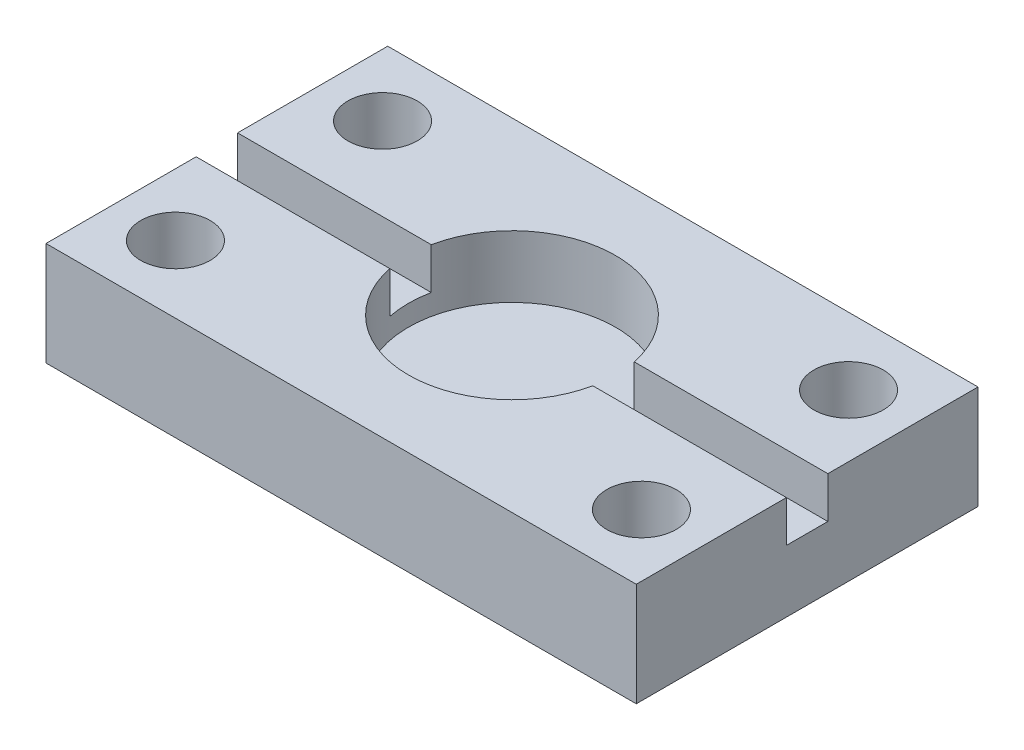
ISO-10303-21;
HEADER;
FILE_DESCRIPTION(('STEP AP214'),'2;1');
FILE_NAME('part.step','',(''),(''),'','','');
FILE_SCHEMA(('AUTOMOTIVE_DESIGN { 1 0 10303 214 1 1 1 1 }'));
ENDSEC;
DATA;
#1=APPLICATION_CONTEXT('core data for automotive mechanical design processes');
#2=APPLICATION_PROTOCOL_DEFINITION('international standard','automotive_design',2000,#1);
#3=PRODUCT_CONTEXT('',#1,'mechanical');
#4=PRODUCT('Part','Part','',(#3));
#5=PRODUCT_RELATED_PRODUCT_CATEGORY('part','',(#4));
#6=PRODUCT_DEFINITION_FORMATION('','',#4);
#7=PRODUCT_DEFINITION_CONTEXT('part definition',#1,'design');
#8=PRODUCT_DEFINITION('design','',#6,#7);
#9=PRODUCT_DEFINITION_SHAPE('','',#8);
#10=(LENGTH_UNIT() NAMED_UNIT(*) SI_UNIT(.MILLI.,.METRE.));
#11=(NAMED_UNIT(*) PLANE_ANGLE_UNIT() SI_UNIT($,.RADIAN.));
#12=(NAMED_UNIT(*) SI_UNIT($,.STERADIAN.) SOLID_ANGLE_UNIT());
#13=UNCERTAINTY_MEASURE_WITH_UNIT(LENGTH_MEASURE(1.E-05),#10,'distance_accuracy_value','');
#14=(GEOMETRIC_REPRESENTATION_CONTEXT(3) GLOBAL_UNCERTAINTY_ASSIGNED_CONTEXT((#13)) GLOBAL_UNIT_ASSIGNED_CONTEXT((#10,
#11,#12)) REPRESENTATION_CONTEXT('',''));
#15=CARTESIAN_POINT('',(0.,0.,0.));
#16=DIRECTION('',(0.,0.,1.));
#17=DIRECTION('',(1.,0.,0.));
#18=AXIS2_PLACEMENT_3D('',#15,#16,#17);
#19=CARTESIAN_POINT('',(0.,6.,-18.5));
#20=DIRECTION('',(0.,0.,-1.));
#21=DIRECTION('',(-1.,0.,0.));
#22=AXIS2_PLACEMENT_3D('',#19,#20,#21);
#23=PLANE('',#22);
#24=DIRECTION('',(-1.,0.,0.));
#25=VECTOR('',#24,1.);
#26=CARTESIAN_POINT('',(0.,6.,-18.5));
#27=LINE('',#26,#25);
#28=CARTESIAN_POINT('',(18.7020410288673,6.,-18.5));
#29=VERTEX_POINT('',#28);
#30=CARTESIAN_POINT('',(0.,6.,-18.5));
#31=VERTEX_POINT('',#30);
#32=EDGE_CURVE('E275',#29,#31,#27,.T.);
#33=ORIENTED_EDGE('',*,*,#32,.F.);
#34=DIRECTION('',(0.,1.,0.));
#35=VECTOR('',#34,1.);
#36=CARTESIAN_POINT('',(18.7020410288673,4.,-18.5));
#37=LINE('',#36,#35);
#38=CARTESIAN_POINT('',(18.7020410288673,10.,-18.5));
#39=VERTEX_POINT('',#38);
#40=EDGE_CURVE('E55',#29,#39,#37,.T.);
#41=ORIENTED_EDGE('',*,*,#40,.T.);
#42=DIRECTION('',(-1.,0.,0.));
#43=VECTOR('',#42,1.);
#44=CARTESIAN_POINT('',(0.,10.,-18.5));
#45=LINE('',#44,#43);
#46=CARTESIAN_POINT('',(0.,10.,-18.5));
#47=VERTEX_POINT('',#46);
#48=EDGE_CURVE('E158',#39,#47,#45,.T.);
#49=ORIENTED_EDGE('',*,*,#48,.T.);
#50=DIRECTION('',(0.,1.,0.));
#51=VECTOR('',#50,1.);
#52=CARTESIAN_POINT('',(0.,6.,-18.5));
#53=LINE('',#52,#51);
#54=EDGE_CURVE('E170',#31,#47,#53,.T.);
#55=ORIENTED_EDGE('',*,*,#54,.F.);
#56=EDGE_LOOP('',(#33,#41,#49,#55));
#57=FACE_BOUND('',#56,.T.);
#58=ADVANCED_FACE('F39',(#57),#23,.F.);
#59=CARTESIAN_POINT('',(0.,6.,-14.5));
#60=DIRECTION('',(0.,0.,1.));
#61=DIRECTION('',(1.,0.,0.));
#62=AXIS2_PLACEMENT_3D('',#59,#60,#61);
#63=PLANE('',#62);
#64=DIRECTION('',(1.,0.,0.));
#65=VECTOR('',#64,1.);
#66=CARTESIAN_POINT('',(0.,6.,-14.5));
#67=LINE('',#66,#65);
#68=CARTESIAN_POINT('',(38.2979589711327,6.,-14.5));
#69=VERTEX_POINT('',#68);
#70=CARTESIAN_POINT('',(57.,6.,-14.5));
#71=VERTEX_POINT('',#70);
#72=EDGE_CURVE('E145',#69,#71,#67,.T.);
#73=ORIENTED_EDGE('',*,*,#72,.F.);
#74=DIRECTION('',(0.,1.,0.));
#75=VECTOR('',#74,1.);
#76=CARTESIAN_POINT('',(38.2979589711327,4.,-14.5));
#77=LINE('',#76,#75);
#78=CARTESIAN_POINT('',(38.2979589711327,10.,-14.5));
#79=VERTEX_POINT('',#78);
#80=EDGE_CURVE('E130',#69,#79,#77,.T.);
#81=ORIENTED_EDGE('',*,*,#80,.T.);
#82=DIRECTION('',(1.,0.,0.));
#83=VECTOR('',#82,1.);
#84=CARTESIAN_POINT('',(0.,10.,-14.5));
#85=LINE('',#84,#83);
#86=CARTESIAN_POINT('',(57.,10.,-14.5));
#87=VERTEX_POINT('',#86);
#88=EDGE_CURVE('E143',#79,#87,#85,.T.);
#89=ORIENTED_EDGE('',*,*,#88,.T.);
#90=DIRECTION('',(0.,1.,0.));
#91=VECTOR('',#90,1.);
#92=CARTESIAN_POINT('',(57.,6.,-14.5));
#93=LINE('',#92,#91);
#94=EDGE_CURVE('E178',#71,#87,#93,.T.);
#95=ORIENTED_EDGE('',*,*,#94,.F.);
#96=EDGE_LOOP('',(#73,#81,#89,#95));
#97=FACE_BOUND('',#96,.T.);
#98=ADVANCED_FACE('F141',(#97),#63,.F.);
#99=CARTESIAN_POINT('',(0.,6.,0.));
#100=DIRECTION('',(0.,1.,0.));
#101=DIRECTION('',(0.,0.,1.));
#102=AXIS2_PLACEMENT_3D('',#99,#100,#101);
#103=PLANE('',#102);
#104=CARTESIAN_POINT('',(28.5,6.,-16.5));
#105=DIRECTION('',(0.,1.,0.));
#106=DIRECTION('',(0.,0.,1.));
#107=AXIS2_PLACEMENT_3D('',#104,#105,#106);
#108=CIRCLE('',#107,10.);
#109=CARTESIAN_POINT('',(38.2979589711327,6.,-18.5));
#110=VERTEX_POINT('',#109);
#111=EDGE_CURVE('E11',#69,#110,#108,.T.);
#112=ORIENTED_EDGE('',*,*,#111,.F.);
#113=ORIENTED_EDGE('',*,*,#72,.T.);
#114=DIRECTION('',(0.,0.,-1.));
#115=VECTOR('',#114,1.);
#116=CARTESIAN_POINT('',(57.,6.,-18.5));
#117=LINE('',#116,#115);
#118=CARTESIAN_POINT('',(57.,6.,-18.5));
#119=VERTEX_POINT('',#118);
#120=EDGE_CURVE('E271',#71,#119,#117,.T.);
#121=ORIENTED_EDGE('',*,*,#120,.T.);
#122=EDGE_CURVE('E163',#119,#110,#27,.T.);
#123=ORIENTED_EDGE('',*,*,#122,.T.);
#124=EDGE_LOOP('',(#112,#113,#121,#123));
#125=FACE_BOUND('',#124,.T.);
#126=ADVANCED_FACE('F306',(#125),#103,.T.);
#127=CARTESIAN_POINT('',(0.,10.,0.));
#128=DIRECTION('',(0.,-1.,0.));
#129=DIRECTION('',(0.,0.,-1.));
#130=AXIS2_PLACEMENT_3D('',#127,#128,#129);
#131=PLANE('',#130);
#132=CARTESIAN_POINT('',(51.,10.,-26.5));
#133=DIRECTION('',(0.,-1.,0.));
#134=DIRECTION('',(0.,0.,-1.));
#135=AXIS2_PLACEMENT_3D('',#132,#133,#134);
#136=CIRCLE('',#135,3.35);
#137=CARTESIAN_POINT('',(51.,10.,-29.85));
#138=VERTEX_POINT('',#137);
#139=EDGE_CURVE('E199',#138,#138,#136,.T.);
#140=ORIENTED_EDGE('',*,*,#139,.T.);
#141=EDGE_LOOP('',(#140));
#142=FACE_BOUND('',#141,.T.);
#143=CARTESIAN_POINT('',(6.,10.,-26.5));
#144=DIRECTION('',(0.,-1.,0.));
#145=DIRECTION('',(0.,0.,-1.));
#146=AXIS2_PLACEMENT_3D('',#143,#144,#145);
#147=CIRCLE('',#146,3.35);
#148=CARTESIAN_POINT('',(6.,10.,-29.85));
#149=VERTEX_POINT('',#148);
#150=EDGE_CURVE('E191',#149,#149,#147,.T.);
#151=ORIENTED_EDGE('',*,*,#150,.T.);
#152=EDGE_LOOP('',(#151));
#153=FACE_BOUND('',#152,.T.);
#154=ORIENTED_EDGE('',*,*,#48,.F.);
#155=CARTESIAN_POINT('',(28.5,10.,-16.5));
#156=DIRECTION('',(0.,1.,0.));
#157=DIRECTION('',(0.,0.,1.));
#158=AXIS2_PLACEMENT_3D('',#155,#156,#157);
#159=CIRCLE('',#158,10.);
#160=CARTESIAN_POINT('',(38.2979589711327,10.,-18.5));
#161=VERTEX_POINT('',#160);
#162=EDGE_CURVE('E137',#161,#39,#159,.T.);
#163=ORIENTED_EDGE('',*,*,#162,.F.);
#164=CARTESIAN_POINT('',(57.,10.,-18.5));
#165=VERTEX_POINT('',#164);
#166=EDGE_CURVE('E165',#165,#161,#45,.T.);
#167=ORIENTED_EDGE('',*,*,#166,.F.);
#168=DIRECTION('',(0.,0.,-1.));
#169=VECTOR('',#168,1.);
#170=CARTESIAN_POINT('',(57.,10.,0.));
#171=LINE('',#170,#169);
#172=CARTESIAN_POINT('',(57.,10.,-33.));
#173=VERTEX_POINT('',#172);
#174=EDGE_CURVE('E223',#165,#173,#171,.T.);
#175=ORIENTED_EDGE('',*,*,#174,.T.);
#176=DIRECTION('',(-1.,0.,0.));
#177=VECTOR('',#176,1.);
#178=CARTESIAN_POINT('',(0.,10.,-33.));
#179=LINE('',#178,#177);
#180=CARTESIAN_POINT('',(0.,10.,-33.));
#181=VERTEX_POINT('',#180);
#182=EDGE_CURVE('E226',#173,#181,#179,.T.);
#183=ORIENTED_EDGE('',*,*,#182,.T.);
#184=DIRECTION('',(0.,0.,1.));
#185=VECTOR('',#184,1.);
#186=CARTESIAN_POINT('',(0.,10.,0.));
#187=LINE('',#186,#185);
#188=EDGE_CURVE('E215',#181,#47,#187,.T.);
#189=ORIENTED_EDGE('',*,*,#188,.T.);
#190=EDGE_LOOP('',(#154,#163,#167,#175,#183,#189));
#191=FACE_BOUND('',#190,.T.);
#192=ADVANCED_FACE('F292',(#142,#153,#191),#131,.F.);
#193=CARTESIAN_POINT('',(0.,10.,0.));
#194=DIRECTION('',(1.,0.,0.));
#195=DIRECTION('',(0.,0.,-1.));
#196=AXIS2_PLACEMENT_3D('',#193,#194,#195);
#197=PLANE('',#196);
#198=DIRECTION('',(0.,0.,1.));
#199=VECTOR('',#198,1.);
#200=CARTESIAN_POINT('',(0.,6.,-18.5));
#201=LINE('',#200,#199);
#202=CARTESIAN_POINT('',(0.,6.,-14.5));
#203=VERTEX_POINT('',#202);
#204=EDGE_CURVE('E169',#31,#203,#201,.T.);
#205=ORIENTED_EDGE('',*,*,#204,.F.);
#206=ORIENTED_EDGE('',*,*,#54,.T.);
#207=ORIENTED_EDGE('',*,*,#188,.F.);
#208=DIRECTION('',(0.,-1.,0.));
#209=VECTOR('',#208,1.);
#210=CARTESIAN_POINT('',(0.,10.,-33.));
#211=LINE('',#210,#209);
#212=CARTESIAN_POINT('',(0.,0.,-33.));
#213=VERTEX_POINT('',#212);
#214=EDGE_CURVE('E229',#181,#213,#211,.T.);
#215=ORIENTED_EDGE('',*,*,#214,.T.);
#216=DIRECTION('',(0.,0.,1.));
#217=VECTOR('',#216,1.);
#218=CARTESIAN_POINT('',(0.,0.,0.));
#219=LINE('',#218,#217);
#220=CARTESIAN_POINT('',(0.,0.,0.));
#221=VERTEX_POINT('',#220);
#222=EDGE_CURVE('E211',#213,#221,#219,.T.);
#223=ORIENTED_EDGE('',*,*,#222,.T.);
#224=DIRECTION('',(0.,-1.,0.));
#225=VECTOR('',#224,1.);
#226=CARTESIAN_POINT('',(0.,10.,0.));
#227=LINE('',#226,#225);
#228=CARTESIAN_POINT('',(0.,10.,0.));
#229=VERTEX_POINT('',#228);
#230=EDGE_CURVE('E252',#229,#221,#227,.T.);
#231=ORIENTED_EDGE('',*,*,#230,.F.);
#232=CARTESIAN_POINT('',(0.,10.,-14.5));
#233=VERTEX_POINT('',#232);
#234=EDGE_CURVE('E220',#233,#229,#187,.T.);
#235=ORIENTED_EDGE('',*,*,#234,.F.);
#236=DIRECTION('',(0.,1.,0.));
#237=VECTOR('',#236,1.);
#238=CARTESIAN_POINT('',(0.,6.,-14.5));
#239=LINE('',#238,#237);
#240=EDGE_CURVE('E63',#203,#233,#239,.T.);
#241=ORIENTED_EDGE('',*,*,#240,.F.);
#242=EDGE_LOOP('',(#205,#206,#207,#215,#223,#231,#235,#241));
#243=FACE_BOUND('',#242,.T.);
#244=ADVANCED_FACE('F41',(#243),#197,.F.);
#245=CARTESIAN_POINT('',(0.,10.,0.));
#246=DIRECTION('',(0.,0.,-1.));
#247=DIRECTION('',(-1.,0.,0.));
#248=AXIS2_PLACEMENT_3D('',#245,#246,#247);
#249=PLANE('',#248);
#250=DIRECTION('',(1.,0.,0.));
#251=VECTOR('',#250,1.);
#252=CARTESIAN_POINT('',(0.,0.,0.));
#253=LINE('',#252,#251);
#254=CARTESIAN_POINT('',(57.,0.,0.));
#255=VERTEX_POINT('',#254);
#256=EDGE_CURVE('E233',#221,#255,#253,.T.);
#257=ORIENTED_EDGE('',*,*,#256,.T.);
#258=DIRECTION('',(0.,-1.,0.));
#259=VECTOR('',#258,1.);
#260=CARTESIAN_POINT('',(57.,10.,0.));
#261=LINE('',#260,#259);
#262=CARTESIAN_POINT('',(57.,10.,0.));
#263=VERTEX_POINT('',#262);
#264=EDGE_CURVE('E249',#263,#255,#261,.T.);
#265=ORIENTED_EDGE('',*,*,#264,.F.);
#266=DIRECTION('',(1.,0.,0.));
#267=VECTOR('',#266,1.);
#268=CARTESIAN_POINT('',(0.,10.,0.));
#269=LINE('',#268,#267);
#270=EDGE_CURVE('E219',#229,#263,#269,.T.);
#271=ORIENTED_EDGE('',*,*,#270,.F.);
#272=ORIENTED_EDGE('',*,*,#230,.T.);
#273=EDGE_LOOP('',(#257,#265,#271,#272));
#274=FACE_BOUND('',#273,.T.);
#275=ADVANCED_FACE('F323',(#274),#249,.F.);
#276=CARTESIAN_POINT('',(57.,10.,0.));
#277=DIRECTION('',(-1.,0.,0.));
#278=DIRECTION('',(0.,0.,1.));
#279=AXIS2_PLACEMENT_3D('',#276,#277,#278);
#280=PLANE('',#279);
#281=ORIENTED_EDGE('',*,*,#174,.F.);
#282=DIRECTION('',(0.,1.,0.));
#283=VECTOR('',#282,1.);
#284=CARTESIAN_POINT('',(57.,6.,-18.5));
#285=LINE('',#284,#283);
#286=EDGE_CURVE('E175',#119,#165,#285,.T.);
#287=ORIENTED_EDGE('',*,*,#286,.F.);
#288=ORIENTED_EDGE('',*,*,#120,.F.);
#289=ORIENTED_EDGE('',*,*,#94,.T.);
#290=EDGE_CURVE('E152',#263,#87,#171,.T.);
#291=ORIENTED_EDGE('',*,*,#290,.F.);
#292=ORIENTED_EDGE('',*,*,#264,.T.);
#293=DIRECTION('',(0.,0.,-1.));
#294=VECTOR('',#293,1.);
#295=CARTESIAN_POINT('',(57.,0.,0.));
#296=LINE('',#295,#294);
#297=CARTESIAN_POINT('',(57.,0.,-33.));
#298=VERTEX_POINT('',#297);
#299=EDGE_CURVE('E236',#255,#298,#296,.T.);
#300=ORIENTED_EDGE('',*,*,#299,.T.);
#301=DIRECTION('',(0.,-1.,0.));
#302=VECTOR('',#301,1.);
#303=CARTESIAN_POINT('',(57.,10.,-33.));
#304=LINE('',#303,#302);
#305=EDGE_CURVE('E245',#173,#298,#304,.T.);
#306=ORIENTED_EDGE('',*,*,#305,.F.);
#307=EDGE_LOOP('',(#281,#287,#288,#289,#291,#292,#300,#306));
#308=FACE_BOUND('',#307,.T.);
#309=ADVANCED_FACE('F313',(#308),#280,.F.);
#310=CARTESIAN_POINT('',(0.,10.,-33.));
#311=DIRECTION('',(0.,0.,1.));
#312=DIRECTION('',(1.,0.,0.));
#313=AXIS2_PLACEMENT_3D('',#310,#311,#312);
#314=PLANE('',#313);
#315=DIRECTION('',(-1.,0.,0.));
#316=VECTOR('',#315,1.);
#317=CARTESIAN_POINT('',(0.,0.,-33.));
#318=LINE('',#317,#316);
#319=EDGE_CURVE('E239',#298,#213,#318,.T.);
#320=ORIENTED_EDGE('',*,*,#319,.T.);
#321=ORIENTED_EDGE('',*,*,#214,.F.);
#322=ORIENTED_EDGE('',*,*,#182,.F.);
#323=ORIENTED_EDGE('',*,*,#305,.T.);
#324=EDGE_LOOP('',(#320,#321,#322,#323));
#325=FACE_BOUND('',#324,.T.);
#326=ADVANCED_FACE('F319',(#325),#314,.F.);
#327=CARTESIAN_POINT('',(51.,10.,-6.5));
#328=DIRECTION('',(0.,-1.,0.));
#329=DIRECTION('',(0.,0.,-1.));
#330=AXIS2_PLACEMENT_3D('',#327,#328,#329);
#331=CIRCLE('',#330,3.35);
#332=CARTESIAN_POINT('',(51.,10.,-9.85));
#333=VERTEX_POINT('',#332);
#334=EDGE_CURVE('E183',#333,#333,#331,.T.);
#335=ORIENTED_EDGE('',*,*,#334,.T.);
#336=EDGE_LOOP('',(#335));
#337=FACE_BOUND('',#336,.T.);
#338=CARTESIAN_POINT('',(6.,10.,-6.5));
#339=DIRECTION('',(0.,-1.,0.));
#340=DIRECTION('',(0.,0.,-1.));
#341=AXIS2_PLACEMENT_3D('',#338,#339,#340);
#342=CIRCLE('',#341,3.35);
#343=CARTESIAN_POINT('',(6.,10.,-9.85));
#344=VERTEX_POINT('',#343);
#345=EDGE_CURVE('E207',#344,#344,#342,.T.);
#346=ORIENTED_EDGE('',*,*,#345,.T.);
#347=EDGE_LOOP('',(#346));
#348=FACE_BOUND('',#347,.T.);
#349=ORIENTED_EDGE('',*,*,#88,.F.);
#350=CARTESIAN_POINT('',(18.7020410288673,10.,-14.5));
#351=VERTEX_POINT('',#350);
#352=EDGE_CURVE('E127',#351,#79,#159,.T.);
#353=ORIENTED_EDGE('',*,*,#352,.F.);
#354=EDGE_CURVE('E154',#233,#351,#85,.T.);
#355=ORIENTED_EDGE('',*,*,#354,.F.);
#356=ORIENTED_EDGE('',*,*,#234,.T.);
#357=ORIENTED_EDGE('',*,*,#270,.T.);
#358=ORIENTED_EDGE('',*,*,#290,.T.);
#359=EDGE_LOOP('',(#349,#353,#355,#356,#357,#358));
#360=FACE_BOUND('',#359,.T.);
#361=ADVANCED_FACE('F150',(#337,#348,#360),#131,.F.);
#362=CARTESIAN_POINT('',(0.,0.,0.));
#363=DIRECTION('',(0.,-1.,0.));
#364=DIRECTION('',(0.,0.,-1.));
#365=AXIS2_PLACEMENT_3D('',#362,#363,#364);
#366=PLANE('',#365);
#367=CARTESIAN_POINT('',(51.,0.,-6.5));
#368=DIRECTION('',(0.,-1.,0.));
#369=DIRECTION('',(0.,0.,-1.));
#370=AXIS2_PLACEMENT_3D('',#367,#368,#369);
#371=CIRCLE('',#370,3.35);
#372=CARTESIAN_POINT('',(51.,0.,-9.85));
#373=VERTEX_POINT('',#372);
#374=EDGE_CURVE('E174',#373,#373,#371,.T.);
#375=ORIENTED_EDGE('',*,*,#374,.F.);
#376=EDGE_LOOP('',(#375));
#377=FACE_BOUND('',#376,.T.);
#378=CARTESIAN_POINT('',(6.,0.,-26.5));
#379=DIRECTION('',(0.,-1.,0.));
#380=DIRECTION('',(0.,0.,-1.));
#381=AXIS2_PLACEMENT_3D('',#378,#379,#380);
#382=CIRCLE('',#381,3.35);
#383=CARTESIAN_POINT('',(6.,0.,-29.85));
#384=VERTEX_POINT('',#383);
#385=EDGE_CURVE('E187',#384,#384,#382,.T.);
#386=ORIENTED_EDGE('',*,*,#385,.F.);
#387=EDGE_LOOP('',(#386));
#388=FACE_BOUND('',#387,.T.);
#389=CARTESIAN_POINT('',(51.,0.,-26.5));
#390=DIRECTION('',(0.,-1.,0.));
#391=DIRECTION('',(0.,0.,-1.));
#392=AXIS2_PLACEMENT_3D('',#389,#390,#391);
#393=CIRCLE('',#392,3.35);
#394=CARTESIAN_POINT('',(51.,0.,-29.85));
#395=VERTEX_POINT('',#394);
#396=EDGE_CURVE('E195',#395,#395,#393,.T.);
#397=ORIENTED_EDGE('',*,*,#396,.F.);
#398=EDGE_LOOP('',(#397));
#399=FACE_BOUND('',#398,.T.);
#400=CARTESIAN_POINT('',(6.,0.,-6.5));
#401=DIRECTION('',(0.,-1.,0.));
#402=DIRECTION('',(0.,0.,-1.));
#403=AXIS2_PLACEMENT_3D('',#400,#401,#402);
#404=CIRCLE('',#403,3.35);
#405=CARTESIAN_POINT('',(6.,0.,-9.85));
#406=VERTEX_POINT('',#405);
#407=EDGE_CURVE('E203',#406,#406,#404,.T.);
#408=ORIENTED_EDGE('',*,*,#407,.F.);
#409=EDGE_LOOP('',(#408));
#410=FACE_BOUND('',#409,.T.);
#411=ORIENTED_EDGE('',*,*,#222,.F.);
#412=ORIENTED_EDGE('',*,*,#319,.F.);
#413=ORIENTED_EDGE('',*,*,#299,.F.);
#414=ORIENTED_EDGE('',*,*,#256,.F.);
#415=EDGE_LOOP('',(#411,#412,#413,#414));
#416=FACE_BOUND('',#415,.T.);
#417=ADVANCED_FACE('F321',(#377,#388,#399,#410,#416),#366,.T.);
#418=CARTESIAN_POINT('',(6.,10.,-6.5));
#419=DIRECTION('',(0.,-1.,0.));
#420=DIRECTION('',(0.,0.,-1.));
#421=AXIS2_PLACEMENT_3D('',#418,#419,#420);
#422=CYLINDRICAL_SURFACE('',#421,3.35);
#423=ORIENTED_EDGE('',*,*,#345,.F.);
#424=EDGE_LOOP('',(#423));
#425=FACE_BOUND('',#424,.T.);
#426=ORIENTED_EDGE('',*,*,#407,.T.);
#427=EDGE_LOOP('',(#426));
#428=FACE_BOUND('',#427,.T.);
#429=ADVANCED_FACE('F357',(#425,#428),#422,.F.);
#430=CARTESIAN_POINT('',(51.,10.,-26.5));
#431=DIRECTION('',(0.,-1.,0.));
#432=DIRECTION('',(0.,0.,-1.));
#433=AXIS2_PLACEMENT_3D('',#430,#431,#432);
#434=CYLINDRICAL_SURFACE('',#433,3.35);
#435=ORIENTED_EDGE('',*,*,#139,.F.);
#436=EDGE_LOOP('',(#435));
#437=FACE_BOUND('',#436,.T.);
#438=ORIENTED_EDGE('',*,*,#396,.T.);
#439=EDGE_LOOP('',(#438));
#440=FACE_BOUND('',#439,.T.);
#441=ADVANCED_FACE('F349',(#437,#440),#434,.F.);
#442=CARTESIAN_POINT('',(6.,10.,-26.5));
#443=DIRECTION('',(0.,-1.,0.));
#444=DIRECTION('',(0.,0.,-1.));
#445=AXIS2_PLACEMENT_3D('',#442,#443,#444);
#446=CYLINDRICAL_SURFACE('',#445,3.35);
#447=ORIENTED_EDGE('',*,*,#150,.F.);
#448=EDGE_LOOP('',(#447));
#449=FACE_BOUND('',#448,.T.);
#450=ORIENTED_EDGE('',*,*,#385,.T.);
#451=EDGE_LOOP('',(#450));
#452=FACE_BOUND('',#451,.T.);
#453=ADVANCED_FACE('F343',(#449,#452),#446,.F.);
#454=CARTESIAN_POINT('',(51.,10.,-6.5));
#455=DIRECTION('',(0.,-1.,0.));
#456=DIRECTION('',(0.,0.,-1.));
#457=AXIS2_PLACEMENT_3D('',#454,#455,#456);
#458=CYLINDRICAL_SURFACE('',#457,3.35);
#459=ORIENTED_EDGE('',*,*,#334,.F.);
#460=EDGE_LOOP('',(#459));
#461=FACE_BOUND('',#460,.T.);
#462=ORIENTED_EDGE('',*,*,#374,.T.);
#463=EDGE_LOOP('',(#462));
#464=FACE_BOUND('',#463,.T.);
#465=ADVANCED_FACE('F338',(#461,#464),#458,.F.);
#466=ORIENTED_EDGE('',*,*,#166,.T.);
#467=DIRECTION('',(0.,1.,0.));
#468=VECTOR('',#467,1.);
#469=CARTESIAN_POINT('',(38.2979589711327,4.,-18.5));
#470=LINE('',#469,#468);
#471=EDGE_CURVE('E147',#161,#110,#470,.F.);
#472=ORIENTED_EDGE('',*,*,#471,.T.);
#473=ORIENTED_EDGE('',*,*,#122,.F.);
#474=ORIENTED_EDGE('',*,*,#286,.T.);
#475=EDGE_LOOP('',(#466,#472,#473,#474));
#476=FACE_BOUND('',#475,.T.);
#477=ADVANCED_FACE('F310',(#476),#23,.F.);
#478=ORIENTED_EDGE('',*,*,#354,.T.);
#479=DIRECTION('',(0.,1.,0.));
#480=VECTOR('',#479,1.);
#481=CARTESIAN_POINT('',(18.7020410288673,4.,-14.5));
#482=LINE('',#481,#480);
#483=CARTESIAN_POINT('',(18.7020410288673,6.,-14.5));
#484=VERTEX_POINT('',#483);
#485=EDGE_CURVE('E133',#351,#484,#482,.F.);
#486=ORIENTED_EDGE('',*,*,#485,.T.);
#487=EDGE_CURVE('E263',#203,#484,#67,.T.);
#488=ORIENTED_EDGE('',*,*,#487,.F.);
#489=ORIENTED_EDGE('',*,*,#240,.T.);
#490=EDGE_LOOP('',(#478,#486,#488,#489));
#491=FACE_BOUND('',#490,.T.);
#492=ADVANCED_FACE('F262',(#491),#63,.F.);
#493=EDGE_CURVE('E43',#29,#484,#108,.T.);
#494=ORIENTED_EDGE('',*,*,#493,.F.);
#495=ORIENTED_EDGE('',*,*,#32,.T.);
#496=ORIENTED_EDGE('',*,*,#204,.T.);
#497=ORIENTED_EDGE('',*,*,#487,.T.);
#498=EDGE_LOOP('',(#494,#495,#496,#497));
#499=FACE_BOUND('',#498,.T.);
#500=ADVANCED_FACE('F268',(#499),#103,.T.);
#501=CARTESIAN_POINT('',(28.5,4.,-16.5));
#502=DIRECTION('',(0.,1.,0.));
#503=DIRECTION('',(0.,0.,1.));
#504=AXIS2_PLACEMENT_3D('',#501,#502,#503);
#505=CYLINDRICAL_SURFACE('',#504,10.);
#506=CARTESIAN_POINT('',(28.5,4.,-16.5));
#507=DIRECTION('',(0.,1.,0.));
#508=DIRECTION('',(0.,0.,1.));
#509=AXIS2_PLACEMENT_3D('',#506,#507,#508);
#510=CIRCLE('',#509,10.);
#511=CARTESIAN_POINT('',(28.5,4.,-6.5));
#512=VERTEX_POINT('',#511);
#513=EDGE_CURVE('E266',#512,#512,#510,.T.);
#514=ORIENTED_EDGE('',*,*,#513,.F.);
#515=EDGE_LOOP('',(#514));
#516=FACE_BOUND('',#515,.T.);
#517=ORIENTED_EDGE('',*,*,#162,.T.);
#518=ORIENTED_EDGE('',*,*,#40,.F.);
#519=ORIENTED_EDGE('',*,*,#493,.T.);
#520=ORIENTED_EDGE('',*,*,#485,.F.);
#521=ORIENTED_EDGE('',*,*,#352,.T.);
#522=ORIENTED_EDGE('',*,*,#80,.F.);
#523=ORIENTED_EDGE('',*,*,#111,.T.);
#524=ORIENTED_EDGE('',*,*,#471,.F.);
#525=EDGE_LOOP('',(#517,#518,#519,#520,#521,#522,#523,#524));
#526=FACE_BOUND('',#525,.T.);
#527=ADVANCED_FACE('F129',(#516,#526),#505,.F.);
#528=CARTESIAN_POINT('',(28.5,4.,-16.5));
#529=DIRECTION('',(0.,1.,0.));
#530=DIRECTION('',(0.,0.,1.));
#531=AXIS2_PLACEMENT_3D('',#528,#529,#530);
#532=PLANE('',#531);
#533=ORIENTED_EDGE('',*,*,#513,.T.);
#534=EDGE_LOOP('',(#533));
#535=FACE_BOUND('',#534,.T.);
#536=ADVANCED_FACE('F447',(#535),#532,.T.);
#537=CLOSED_SHELL('',(#58,#98,#126,#192,#244,#275,#309,#326,#361,#417,#429,#441,#453,#465,#477,
#492,#500,#527,#536));
#538=MANIFOLD_SOLID_BREP('B2',#537);
#539=ADVANCED_BREP_SHAPE_REPRESENTATION('',(#18,#538),#14);
#540=SHAPE_DEFINITION_REPRESENTATION(#9,#539);
ENDSEC;
END-ISO-10303-21;
